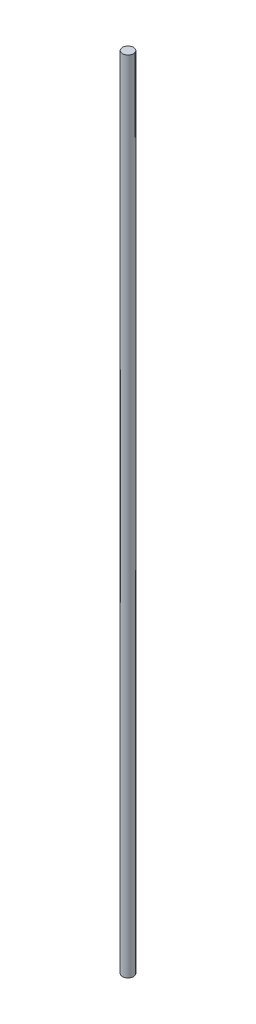
ISO-10303-21;
HEADER;
FILE_DESCRIPTION(('STEP AP214'),'2;1');
FILE_NAME('part.step','',(''),(''),'','','');
FILE_SCHEMA(('AUTOMOTIVE_DESIGN { 1 0 10303 214 1 1 1 1 }'));
ENDSEC;
DATA;
#1=APPLICATION_CONTEXT('core data for automotive mechanical design processes');
#2=APPLICATION_PROTOCOL_DEFINITION('international standard','automotive_design',2000,#1);
#3=PRODUCT_CONTEXT('',#1,'mechanical');
#4=PRODUCT('Part','Part','',(#3));
#5=PRODUCT_RELATED_PRODUCT_CATEGORY('part','',(#4));
#6=PRODUCT_DEFINITION_FORMATION('','',#4);
#7=PRODUCT_DEFINITION_CONTEXT('part definition',#1,'design');
#8=PRODUCT_DEFINITION('design','',#6,#7);
#9=PRODUCT_DEFINITION_SHAPE('','',#8);
#10=(LENGTH_UNIT() NAMED_UNIT(*) SI_UNIT(.MILLI.,.METRE.));
#11=(NAMED_UNIT(*) PLANE_ANGLE_UNIT() SI_UNIT($,.RADIAN.));
#12=(NAMED_UNIT(*) SI_UNIT($,.STERADIAN.) SOLID_ANGLE_UNIT());
#13=UNCERTAINTY_MEASURE_WITH_UNIT(LENGTH_MEASURE(1.E-05),#10,'distance_accuracy_value','');
#14=(GEOMETRIC_REPRESENTATION_CONTEXT(3) GLOBAL_UNCERTAINTY_ASSIGNED_CONTEXT((#13)) GLOBAL_UNIT_ASSIGNED_CONTEXT((#10,
#11,#12)) REPRESENTATION_CONTEXT('',''));
#15=CARTESIAN_POINT('',(0.,0.,0.));
#16=DIRECTION('',(0.,0.,1.));
#17=DIRECTION('',(1.,0.,0.));
#18=AXIS2_PLACEMENT_3D('',#15,#16,#17);
#19=CARTESIAN_POINT('',(0.,580.,0.));
#20=DIRECTION('',(0.,-1.,0.));
#21=DIRECTION('',(0.,0.,-1.));
#22=AXIS2_PLACEMENT_3D('',#19,#20,#21);
#23=CYLINDRICAL_SURFACE('',#22,4.);
#24=CARTESIAN_POINT('',(0.,580.,0.));
#25=DIRECTION('',(0.,1.,0.));
#26=DIRECTION('',(0.,0.,1.));
#27=AXIS2_PLACEMENT_3D('',#24,#25,#26);
#28=CIRCLE('',#27,4.);
#29=CARTESIAN_POINT('',(0.,580.,4.));
#30=VERTEX_POINT('',#29);
#31=EDGE_CURVE('E10',#30,#30,#28,.T.);
#32=ORIENTED_EDGE('',*,*,#31,.F.);
#33=EDGE_LOOP('',(#32));
#34=FACE_BOUND('',#33,.T.);
#35=CARTESIAN_POINT('',(0.,0.,0.));
#36=DIRECTION('',(0.,1.,0.));
#37=DIRECTION('',(0.,0.,1.));
#38=AXIS2_PLACEMENT_3D('',#35,#36,#37);
#39=CIRCLE('',#38,4.);
#40=CARTESIAN_POINT('',(0.,0.,4.));
#41=VERTEX_POINT('',#40);
#42=EDGE_CURVE('E36',#41,#41,#39,.T.);
#43=ORIENTED_EDGE('',*,*,#42,.T.);
#44=EDGE_LOOP('',(#43));
#45=FACE_BOUND('',#44,.T.);
#46=ADVANCED_FACE('F33',(#34,#45),#23,.T.);
#47=CARTESIAN_POINT('',(0.,580.,0.));
#48=DIRECTION('',(0.,1.,0.));
#49=DIRECTION('',(0.,0.,1.));
#50=AXIS2_PLACEMENT_3D('',#47,#48,#49);
#51=PLANE('',#50);
#52=ORIENTED_EDGE('',*,*,#31,.T.);
#53=EDGE_LOOP('',(#52));
#54=FACE_BOUND('',#53,.T.);
#55=ADVANCED_FACE('F48',(#54),#51,.T.);
#56=CARTESIAN_POINT('',(0.,0.,0.));
#57=DIRECTION('',(0.,1.,0.));
#58=DIRECTION('',(0.,0.,1.));
#59=AXIS2_PLACEMENT_3D('',#56,#57,#58);
#60=PLANE('',#59);
#61=ORIENTED_EDGE('',*,*,#42,.F.);
#62=EDGE_LOOP('',(#61));
#63=FACE_BOUND('',#62,.T.);
#64=ADVANCED_FACE('F46',(#63),#60,.F.);
#65=CLOSED_SHELL('',(#46,#55,#64));
#66=MANIFOLD_SOLID_BREP('B2',#65);
#67=ADVANCED_BREP_SHAPE_REPRESENTATION('',(#18,#66),#14);
#68=SHAPE_DEFINITION_REPRESENTATION(#9,#67);
ENDSEC;
END-ISO-10303-21;
